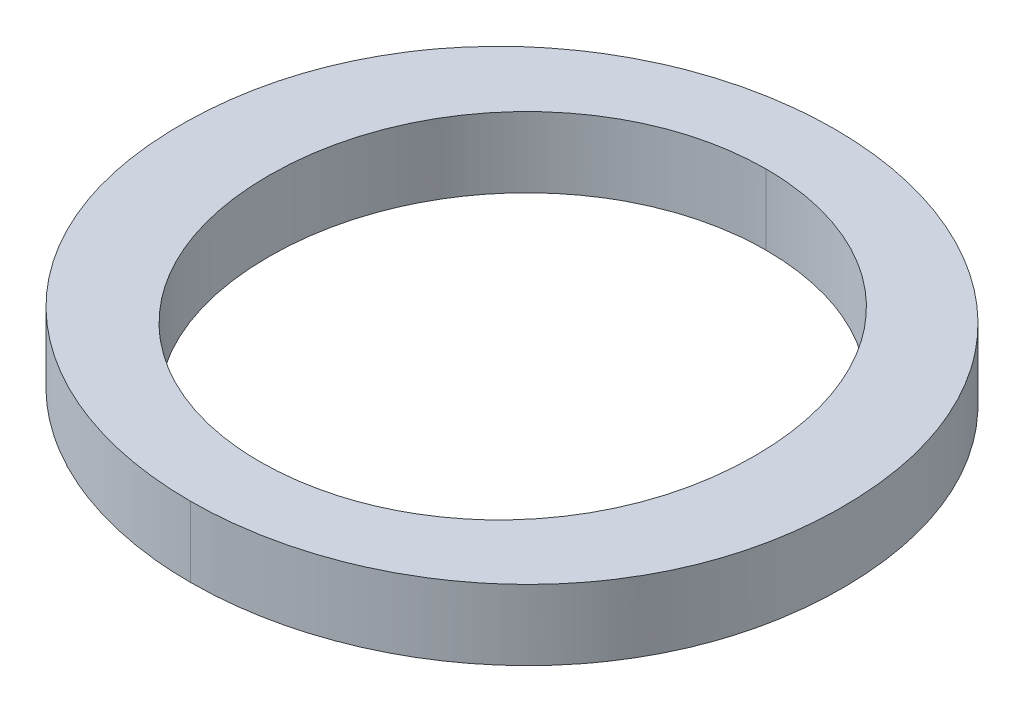
ISO-10303-21;
HEADER;
FILE_DESCRIPTION(('STEP AP214'),'2;1');
FILE_NAME('part.step','',(''),(''),'','','');
FILE_SCHEMA(('AUTOMOTIVE_DESIGN { 1 0 10303 214 1 1 1 1 }'));
ENDSEC;
DATA;
#1=APPLICATION_CONTEXT('core data for automotive mechanical design processes');
#2=APPLICATION_PROTOCOL_DEFINITION('international standard','automotive_design',2000,#1);
#3=PRODUCT_CONTEXT('',#1,'mechanical');
#4=PRODUCT('Part','Part','',(#3));
#5=PRODUCT_RELATED_PRODUCT_CATEGORY('part','',(#4));
#6=PRODUCT_DEFINITION_FORMATION('','',#4);
#7=PRODUCT_DEFINITION_CONTEXT('part definition',#1,'design');
#8=PRODUCT_DEFINITION('design','',#6,#7);
#9=PRODUCT_DEFINITION_SHAPE('','',#8);
#10=(LENGTH_UNIT() NAMED_UNIT(*) SI_UNIT(.MILLI.,.METRE.));
#11=(NAMED_UNIT(*) PLANE_ANGLE_UNIT() SI_UNIT($,.RADIAN.));
#12=(NAMED_UNIT(*) SI_UNIT($,.STERADIAN.) SOLID_ANGLE_UNIT());
#13=UNCERTAINTY_MEASURE_WITH_UNIT(LENGTH_MEASURE(1.E-05),#10,'distance_accuracy_value','');
#14=(GEOMETRIC_REPRESENTATION_CONTEXT(3) GLOBAL_UNCERTAINTY_ASSIGNED_CONTEXT((#13)) GLOBAL_UNIT_ASSIGNED_CONTEXT((#10,
#11,#12)) REPRESENTATION_CONTEXT('',''));
#15=CARTESIAN_POINT('',(0.,0.,0.));
#16=DIRECTION('',(0.,0.,1.));
#17=DIRECTION('',(1.,0.,0.));
#18=AXIS2_PLACEMENT_3D('',#15,#16,#17);
#19=CARTESIAN_POINT('',(-26.751562473,12.954,-114.301890999));
#20=DIRECTION('',(0.,1.,0.));
#21=DIRECTION('',(0.,0.,1.));
#22=AXIS2_PLACEMENT_3D('',#19,#20,#21);
#23=PLANE('',#22);
#24=CARTESIAN_POINT('',(-25.5364239390392,12.954,-112.210124931));
#25=CARTESIAN_POINT('',(-25.5106206089015,12.954,-112.210124245059));
#26=CARTESIAN_POINT('',(-25.4848259569282,12.954,-112.211182271389));
#27=CARTESIAN_POINT('',(-25.43340858485,12.954,-112.215467339882));
#28=CARTESIAN_POINT('',(-25.4077859330739,12.954,-112.21869519785));
#29=CARTESIAN_POINT('',(-25.3314540776071,12.954,-112.231706926495));
#30=CARTESIAN_POINT('',(-25.281263668217,12.954,-112.244818884106));
#31=CARTESIAN_POINT('',(-25.1851064529542,12.954,-112.27944918463));
#32=CARTESIAN_POINT('',(-25.1390721551074,12.954,-112.300781227924));
#33=CARTESIAN_POINT('',(-25.0515879250059,12.954,-112.351301114305));
#34=CARTESIAN_POINT('',(-25.0101328534025,12.954,-112.3804800217));
#35=CARTESIAN_POINT('',(-24.9352562175803,12.954,-112.443949863995));
#36=CARTESIAN_POINT('',(-24.9015162505308,12.954,-112.477866630236));
#37=CARTESIAN_POINT('',(-24.8401659182951,12.954,-112.550854055029));
#38=CARTESIAN_POINT('',(-24.8125564494561,12.954,-112.589925465916));
#39=CARTESIAN_POINT('',(-24.7638893603896,12.954,-112.672328247418));
#40=CARTESIAN_POINT('',(-24.7428811126103,12.954,-112.715688672155));
#41=CARTESIAN_POINT('',(-24.7079424083198,12.954,-112.80515290053));
#42=CARTESIAN_POINT('',(-24.6940130623446,12.954,-112.851257133349));
#43=CARTESIAN_POINT('',(-24.6724498315564,12.954,-112.948177940799));
#44=CARTESIAN_POINT('',(-24.6653024695735,12.954,-112.999102882565));
#45=CARTESIAN_POINT('',(-24.6602092427702,12.954,-113.075830248181));
#46=CARTESIAN_POINT('',(-24.659451407731,12.954,-113.101486913085));
#47=CARTESIAN_POINT('',(-24.6597382380023,12.954,-113.152797586881));
#48=CARTESIAN_POINT('',(-24.6607830469167,12.954,-113.178451595398));
#49=CARTESIAN_POINT('',(-24.6650369414751,12.954,-113.233190432615));
#50=CARTESIAN_POINT('',(-24.6685277786282,12.954,-113.262254294482));
#51=CARTESIAN_POINT('',(-24.6780316448757,12.954,-113.319958294908));
#52=CARTESIAN_POINT('',(-24.6840447121588,12.954,-113.348598427045));
#53=CARTESIAN_POINT('',(-24.7059504580031,12.954,-113.433460896468));
#54=CARTESIAN_POINT('',(-24.7257188245342,12.954,-113.488752831852));
#55=CARTESIAN_POINT('',(-24.7738963640096,12.954,-113.591100850464));
#56=CARTESIAN_POINT('',(-24.8016697297799,12.954,-113.638457740123));
#57=CARTESIAN_POINT('',(-24.8655881539914,12.954,-113.727175776605));
#58=CARTESIAN_POINT('',(-24.9017316725486,12.954,-113.768538024008));
#59=CARTESIAN_POINT('',(-24.9773924322689,12.954,-113.839954813731));
#60=CARTESIAN_POINT('',(-25.0162453354519,12.954,-113.870716077181));
#61=CARTESIAN_POINT('',(-25.0987174834469,12.954,-113.92499789025));
#62=CARTESIAN_POINT('',(-25.1423356895447,12.954,-113.948520013565));
#63=CARTESIAN_POINT('',(-25.2314552689444,12.954,-113.986986180677));
#64=CARTESIAN_POINT('',(-25.2768452125777,12.954,-114.002190306649));
#65=CARTESIAN_POINT('',(-25.3694706637422,12.954,-114.024919236854));
#66=CARTESIAN_POINT('',(-25.416703850443,12.954,-114.032453393808));
#67=CARTESIAN_POINT('',(-25.4761968074136,12.954,-114.037167414555));
#68=CARTESIAN_POINT('',(-25.488242490633,12.954,-114.037878245098));
#69=CARTESIAN_POINT('',(-25.5123321044532,12.954,-114.038822401001));
#70=CARTESIAN_POINT('',(-25.5243760032158,12.954,-114.03905653613));
#71=CARTESIAN_POINT('',(-25.5364239390392,12.954,-114.039057222));
#72=B_SPLINE_CURVE_WITH_KNOTS('',3,(#24,#25,#26,#27,#28,#29,#30,#31,#32,#33,#34,#35,#36,#37,#38,
#39,#40,#41,#42,#43,#44,#45,#46,#47,#48,#49,#50,#51,#52,#53,#54,#55,#56,#57,#58,#59,#60,#61,#62,
#63,#64,#65,#66,#67,#68,#69,#70,#71),.UNSPECIFIED.,.F.,.F.,(4,2,2,2,2,2,2,2,2,2,2,2,2,2,2,2,2,2,
2,2,2,2,2,4),(0.,0.0773680171093985,0.154765138996763,0.309508146777117,0.460932783036454,
0.612185707939161,0.755033723289658,0.897902610879189,1.04181593355671,1.185751826346,
1.33937016938016,1.41632379148428,1.49328354422125,1.58098605158486,1.66868988688921,
1.84371937983329,2.00751840984756,2.17128732913191,2.3192178197525,2.4671161294065,
2.61007854728889,2.75286642795938,2.78906126565284,2.82519456707597),.UNSPECIFIED.);
#73=CARTESIAN_POINT('',(-25.5364239390392,12.954,-112.210124931));
#74=VERTEX_POINT('',#73);
#75=CARTESIAN_POINT('',(-25.5364239390196,12.954,-114.039057222));
#76=VERTEX_POINT('',#75);
#77=EDGE_CURVE('E78',#74,#76,#72,.T.);
#78=ORIENTED_EDGE('',*,*,#77,.F.);
#79=CARTESIAN_POINT('',(-25.5364239390392,12.954,-114.039057222));
#80=CARTESIAN_POINT('',(-25.5612123829451,12.954,-114.039058509188));
#81=CARTESIAN_POINT('',(-25.5859914255243,12.954,-114.038030512108));
#82=CARTESIAN_POINT('',(-25.6353772773855,12.954,-114.033891479779));
#83=CARTESIAN_POINT('',(-25.6599840664513,12.954,-114.030780204037));
#84=CARTESIAN_POINT('',(-25.7332215915287,12.954,-114.01829969386));
#85=CARTESIAN_POINT('',(-25.7813574582871,12.954,-114.005783938767));
#86=CARTESIAN_POINT('',(-25.8742299662193,12.954,-113.972789830264));
#87=CARTESIAN_POINT('',(-25.9189966207895,12.954,-113.952395188882));
#88=CARTESIAN_POINT('',(-26.0043703675999,12.954,-113.904257259582));
#89=CARTESIAN_POINT('',(-26.04497902527,12.954,-113.876516751495));
#90=CARTESIAN_POINT('',(-26.1202557154007,12.954,-113.815093353156));
#91=CARTESIAN_POINT('',(-26.1550132140715,12.954,-113.781519819943));
#92=CARTESIAN_POINT('',(-26.2185518671057,12.954,-113.709124657691));
#93=CARTESIAN_POINT('',(-26.2473317939899,12.954,-113.670301953446));
#94=CARTESIAN_POINT('',(-26.2988513155795,12.954,-113.587603146991));
#95=CARTESIAN_POINT('',(-26.3214379432142,12.954,-113.543631881036));
#96=CARTESIAN_POINT('',(-26.3592924970375,12.954,-113.452664343206));
#97=CARTESIAN_POINT('',(-26.3745598372042,12.954,-113.405667829454));
#98=CARTESIAN_POINT('',(-26.3982874284844,12.954,-113.307479966681));
#99=CARTESIAN_POINT('',(-26.4063679697442,12.954,-113.256196440019));
#100=CARTESIAN_POINT('',(-26.4125944609852,12.954,-113.17883341245));
#101=CARTESIAN_POINT('',(-26.4136858923633,12.954,-113.152949298344));
#102=CARTESIAN_POINT('',(-26.4139777582284,12.954,-113.10116266428));
#103=CARTESIAN_POINT('',(-26.4131780230878,12.954,-113.075260142879));
#104=CARTESIAN_POINT('',(-26.4094295804439,12.954,-113.02088835643));
#105=CARTESIAN_POINT('',(-26.4062652902534,12.954,-112.99243336767));
#106=CARTESIAN_POINT('',(-26.3974710520772,12.954,-112.935915177639));
#107=CARTESIAN_POINT('',(-26.3918411760795,12.954,-112.907851964955));
#108=CARTESIAN_POINT('',(-26.3711873900081,12.954,-112.824659089898));
#109=CARTESIAN_POINT('',(-26.3523916172406,12.954,-112.770405142286));
#110=CARTESIAN_POINT('',(-26.3062511345635,12.954,-112.669473272805));
#111=CARTESIAN_POINT('',(-26.2794716444952,12.954,-112.622537734798));
#112=CARTESIAN_POINT('',(-26.2332367356292,12.954,-112.556453011523));
#113=CARTESIAN_POINT('',(-26.2168089579211,12.954,-112.535139421848));
#114=CARTESIAN_POINT('',(-26.1820304402471,12.954,-112.494105270213));
#115=CARTESIAN_POINT('',(-26.1636777339707,12.954,-112.474386374359));
#116=CARTESIAN_POINT('',(-26.1091110512595,12.954,-112.421020634598));
#117=CARTESIAN_POINT('',(-26.0707788358556,12.954,-112.389492395813));
#118=CARTESIAN_POINT('',(-25.9892735413517,12.954,-112.333542806637));
#119=CARTESIAN_POINT('',(-25.946101669201,12.954,-112.309119689757));
#120=CARTESIAN_POINT('',(-25.8573056777664,12.954,-112.268569987653));
#121=CARTESIAN_POINT('',(-25.8117670596673,12.954,-112.252255564413));
#122=CARTESIAN_POINT('',(-25.7186456145932,12.954,-112.227430057596));
#123=CARTESIAN_POINT('',(-25.6710652758612,12.954,-112.218909743082));
#124=CARTESIAN_POINT('',(-25.6087448261241,12.954,-112.212890624606));
#125=CARTESIAN_POINT('',(-25.5942857518562,12.954,-112.211850517371));
#126=CARTESIAN_POINT('',(-25.5653608334749,12.954,-112.210468707273));
#127=CARTESIAN_POINT('',(-25.5508950507333,12.954,-112.2101257233));
#128=CARTESIAN_POINT('',(-25.5364239390392,12.954,-112.210124931));
#129=B_SPLINE_CURVE_WITH_KNOTS('',3,(#79,#80,#81,#82,#83,#84,#85,#86,#87,#88,#89,#90,#91,#92,
#93,#94,#95,#96,#97,#98,#99,#100,#101,#102,#103,#104,#105,#106,#107,#108,#109,#110,#111,#112,
#113,#114,#115,#116,#117,#118,#119,#120,#121,#122,#123,#124,#125,#126,#127,#128),.UNSPECIFIED.,
.F.,.F.,(4,2,2,2,2,2,2,2,2,2,2,2,2,2,2,2,2,2,2,2,2,2,2,2,4),(0.,0.0743235024982695,
0.148655586347962,0.297059263163799,0.443927712519011,0.590740662982853,0.735050981476287,
0.879390904490538,1.02702740191968,1.17467571795204,1.32972747498832,1.40739321019826,
1.485065911886,1.57084554991418,1.65662268359135,1.82781820056249,1.98898630675534,
2.06961341747138,2.15032370588849,2.29842680729478,2.44649305547947,2.59094767113844,
2.73523097994419,2.77870931418187,2.822107675365),.UNSPECIFIED.);
#130=EDGE_CURVE('E100',#76,#74,#129,.T.);
#131=ORIENTED_EDGE('',*,*,#130,.F.);
#132=EDGE_LOOP('',(#78,#131));
#133=FACE_BOUND('',#132,.T.);
#134=CARTESIAN_POINT('',(-25.5364239390392,12.954,-114.28793092));
#135=CARTESIAN_POINT('',(-25.5005543909841,12.954,-114.287930292168));
#136=CARTESIAN_POINT('',(-25.4647005670153,12.954,-114.286440516783));
#137=CARTESIAN_POINT('',(-25.3932364629852,12.954,-114.280466014469));
#138=CARTESIAN_POINT('',(-25.3576262339399,12.954,-114.275980678475));
#139=CARTESIAN_POINT('',(-25.2514163079382,12.954,-114.257992868521));
#140=CARTESIAN_POINT('',(-25.1815244820921,12.954,-114.239958506938));
#141=CARTESIAN_POINT('',(-25.046307097493,12.954,-114.192168229553));
#142=CARTESIAN_POINT('',(-24.9809592449423,12.954,-114.162475118525));
#143=CARTESIAN_POINT('',(-24.8566539967808,12.954,-114.091900843024));
#144=CARTESIAN_POINT('',(-24.7976895745716,12.954,-114.051032158575));
#145=CARTESIAN_POINT('',(-24.6915737734291,12.954,-113.96174271112));
#146=CARTESIAN_POINT('',(-24.6439328828399,12.954,-113.91390420941));
#147=CARTESIAN_POINT('',(-24.5580820847713,12.954,-113.810426308709));
#148=CARTESIAN_POINT('',(-24.5198656411091,12.954,-113.754792358364));
#149=CARTESIAN_POINT('',(-24.4563482589453,12.954,-113.64133727148));
#150=CARTESIAN_POINT('',(-24.4303692167986,12.954,-113.583893426942));
#151=CARTESIAN_POINT('',(-24.3883539044631,12.954,-113.465438570098));
#152=CARTESIAN_POINT('',(-24.3723224133394,12.954,-113.404425858593));
#153=CARTESIAN_POINT('',(-24.355595626165,12.954,-113.311363636032));
#154=CARTESIAN_POINT('',(-24.351236903451,12.954,-113.279919513341));
#155=CARTESIAN_POINT('',(-24.3449434054011,12.954,-113.216780818805));
#156=CARTESIAN_POINT('',(-24.3430089565694,12.954,-113.185086213803));
#157=CARTESIAN_POINT('',(-24.3414394820686,12.954,-113.12161864778));
#158=CARTESIAN_POINT('',(-24.3418060894133,12.954,-113.089845647111));
#159=CARTESIAN_POINT('',(-24.3448833987776,12.954,-113.026421633092));
#160=CARTESIAN_POINT('',(-24.3475940328603,12.954,-112.994770616233));
#161=CARTESIAN_POINT('',(-24.3603928730629,12.954,-112.892722960135));
#162=CARTESIAN_POINT('',(-24.3754599219771,12.954,-112.822859811145));
#163=CARTESIAN_POINT('',(-24.4185093813723,12.954,-112.687330803825));
#164=CARTESIAN_POINT('',(-24.4464722450373,12.954,-112.621658763723));
#165=CARTESIAN_POINT('',(-24.5112309489362,12.954,-112.503229371088));
#166=CARTESIAN_POINT('',(-24.5468698913783,12.954,-112.449837189791));
#167=CARTESIAN_POINT('',(-24.6269025009,12.954,-112.350048988269));
#168=CARTESIAN_POINT('',(-24.6712996130382,12.954,-112.303655733813));
#169=CARTESIAN_POINT('',(-24.7657076081287,12.954,-112.220409133775));
#170=CARTESIAN_POINT('',(-24.8154916291578,12.954,-112.18329665463));
#171=CARTESIAN_POINT('',(-24.9202975854966,12.954,-112.117338314469));
#172=CARTESIAN_POINT('',(-24.9753216828923,12.954,-112.088495885583));
#173=CARTESIAN_POINT('',(-25.0624978514888,12.954,-112.050920555251));
#174=CARTESIAN_POINT('',(-25.093351433839,12.954,-112.039081838133));
#175=CARTESIAN_POINT('',(-25.1558706402776,12.954,-112.017899779871));
#176=CARTESIAN_POINT('',(-25.1875355679061,12.954,-112.008554372249));
#177=CARTESIAN_POINT('',(-25.2834545582011,12.954,-111.984291122153));
#178=CARTESIAN_POINT('',(-25.348714474511,12.954,-111.97311138095));
#179=CARTESIAN_POINT('',(-25.4346536124142,12.954,-111.965045764887));
#180=CARTESIAN_POINT('',(-25.455000672686,12.954,-111.963620362876));
#181=CARTESIAN_POINT('',(-25.4957034256797,12.954,-111.961724577855));
#182=CARTESIAN_POINT('',(-25.5160590401761,12.954,-111.961252518364));
#183=CARTESIAN_POINT('',(-25.5364239390392,12.954,-111.961251233));
#184=B_SPLINE_CURVE_WITH_KNOTS('',3,(#134,#135,#136,#137,#138,#139,#140,#141,#142,#143,#144,
#145,#146,#147,#148,#149,#150,#151,#152,#153,#154,#155,#156,#157,#158,#159,#160,#161,#162,#163,
#164,#165,#166,#167,#168,#169,#170,#171,#172,#173,#174,#175,#176,#177,#178,#179,#180,#181,#182,
#183),.UNSPECIFIED.,.F.,.F.,(4,2,2,2,2,2,2,2,2,2,2,2,2,2,2,2,2,2,2,2,2,2,2,2,4),(0.,
0.107545032443165,0.21511193781538,0.430503762815758,0.644750866009941,0.858759684711605,
1.06023854626662,1.26157727972777,1.44982746822075,1.63816802717399,1.73332476213794,
1.82849431155302,1.92373140854121,2.01896574536716,2.23207814573533,2.44486857758019,
2.63646896447007,2.82814486890732,3.01364732071927,3.19922664630442,3.29827351590024,
3.39723803773585,3.59490351218008,3.65608167437615,3.71715215895971),.UNSPECIFIED.);
#185=CARTESIAN_POINT('',(-25.5364239390392,12.954,-114.28793092));
#186=VERTEX_POINT('',#185);
#187=CARTESIAN_POINT('',(-25.5364239390196,12.954,-111.961251233));
#188=VERTEX_POINT('',#187);
#189=EDGE_CURVE('E22',#186,#188,#184,.T.);
#190=ORIENTED_EDGE('',*,*,#189,.F.);
#191=CARTESIAN_POINT('',(-25.5364239390392,12.954,-111.961251233));
#192=CARTESIAN_POINT('',(-25.6095343345229,12.954,-111.961202758672));
#193=CARTESIAN_POINT('',(-25.6827105935566,12.954,-111.96727968449));
#194=CARTESIAN_POINT('',(-25.8272315435797,12.954,-111.991712776202));
#195=CARTESIAN_POINT('',(-25.898569107741,12.954,-112.010110902573));
#196=CARTESIAN_POINT('',(-26.0363291420664,12.954,-112.059005948654));
#197=CARTESIAN_POINT('',(-26.1027883096712,12.954,-112.089398453594));
#198=CARTESIAN_POINT('',(-26.2289446966988,12.954,-112.161817277561));
#199=CARTESIAN_POINT('',(-26.2886529402575,12.954,-112.203824232215));
#200=CARTESIAN_POINT('',(-26.3944631256053,12.954,-112.294720477535));
#201=CARTESIAN_POINT('',(-26.4412730671617,12.954,-112.342784831694));
#202=CARTESIAN_POINT('',(-26.5253090641757,12.954,-112.446642638331));
#203=CARTESIAN_POINT('',(-26.5625419326002,12.954,-112.502430552699));
#204=CARTESIAN_POINT('',(-26.6237269571513,12.954,-112.615437808425));
#205=CARTESIAN_POINT('',(-26.6484684278038,12.954,-112.672232540028));
#206=CARTESIAN_POINT('',(-26.6882634941206,12.954,-112.789130292536));
#207=CARTESIAN_POINT('',(-26.7033114244075,12.954,-112.84923522585));
#208=CARTESIAN_POINT('',(-26.7241532462599,12.954,-112.972357639101));
#209=CARTESIAN_POINT('',(-26.7297375089422,12.954,-113.035410069734));
#210=CARTESIAN_POINT('',(-26.7313709165466,12.954,-113.13006136153));
#211=CARTESIAN_POINT('',(-26.7307886294085,12.954,-113.161647237092));
#212=CARTESIAN_POINT('',(-26.7273226136568,12.954,-113.224691766885));
#213=CARTESIAN_POINT('',(-26.7244389630052,12.954,-113.25615042539));
#214=CARTESIAN_POINT('',(-26.7110193702885,12.954,-113.358638330644));
#215=CARTESIAN_POINT('',(-26.6954153594921,12.954,-113.429094753978));
#216=CARTESIAN_POINT('',(-26.6511749707402,12.954,-113.565696972448));
#217=CARTESIAN_POINT('',(-26.6225575893069,12.954,-113.631848890829));
#218=CARTESIAN_POINT('',(-26.5564962193172,12.954,-113.750972406426));
#219=CARTESIAN_POINT('',(-26.5202318889867,12.954,-113.804600442887));
#220=CARTESIAN_POINT('',(-26.4388961665247,12.954,-113.904727209725));
#221=CARTESIAN_POINT('',(-26.3938216367279,12.954,-113.951223389602));
#222=CARTESIAN_POINT('',(-26.2981590197188,12.954,-114.034412923414));
#223=CARTESIAN_POINT('',(-26.2478158848498,12.954,-114.071389960928));
#224=CARTESIAN_POINT('',(-26.1418945847333,12.954,-114.136946532515));
#225=CARTESIAN_POINT('',(-26.0863142938378,12.954,-114.165522637277));
#226=CARTESIAN_POINT('',(-25.9984519625071,12.954,-114.202514738372));
#227=CARTESIAN_POINT('',(-25.967463169426,12.954,-114.214101433659));
#228=CARTESIAN_POINT('',(-25.9046915523816,12.954,-114.234760601802));
#229=CARTESIAN_POINT('',(-25.8729094823458,12.954,-114.243835369703));
#230=CARTESIAN_POINT('',(-25.7766886639833,12.954,-114.267253143827));
#231=CARTESIAN_POINT('',(-25.7112874251518,12.954,-114.27782628106));
#232=CARTESIAN_POINT('',(-25.6092114817138,12.954,-114.286419885679));
#233=CARTESIAN_POINT('',(-25.5727988004597,12.954,-114.287942415788));
#234=CARTESIAN_POINT('',(-25.5364239390392,12.954,-114.28793092));
#235=B_SPLINE_CURVE_WITH_KNOTS('',3,(#191,#192,#193,#194,#195,#196,#197,#198,#199,#200,#201,
#202,#203,#204,#205,#206,#207,#208,#209,#210,#211,#212,#213,#214,#215,#216,#217,#218,#219,#220,
#221,#222,#223,#224,#225,#226,#227,#228,#229,#230,#231,#232,#233,#234),.UNSPECIFIED.,.F.,.F.,(4,
2,2,2,2,2,2,2,2,2,2,2,2,2,2,2,2,2,2,2,2,4),(0.,0.219182611625406,0.439115482483608,
0.657174569143087,0.874872263183796,1.07506615244159,1.27511723082929,1.46009427720494,
1.64517933532931,1.83431305658222,1.92901980828297,2.02372335179922,2.23890619802735,
2.45377593028106,2.64699908248879,2.84029117500744,3.02689039481226,3.21356568013089,
3.3127250298113,3.41179348032204,3.60964786171972,3.71882891746114),.UNSPECIFIED.);
#236=EDGE_CURVE('E74',#188,#186,#235,.T.);
#237=ORIENTED_EDGE('',*,*,#236,.F.);
#238=EDGE_LOOP('',(#190,#237));
#239=FACE_BOUND('',#238,.T.);
#240=ADVANCED_FACE('F17',(#133,#239),#23,.T.);
#241=CARTESIAN_POINT('',(-25.536423939,12.9794,-114.28793092));
#242=CARTESIAN_POINT('',(-25.536423939,12.6746,-114.28793092));
#243=CARTESIAN_POINT('',(-24.905558054,12.9794,-114.28793092));
#244=CARTESIAN_POINT('',(-24.905558054,12.6746,-114.28793092));
#245=CARTESIAN_POINT('',(-24.341830189,12.9794,-113.827225191));
#246=CARTESIAN_POINT('',(-24.341830189,12.6746,-113.827225191));
#247=CARTESIAN_POINT('',(-24.341830189,12.9794,-112.41501165));
#248=CARTESIAN_POINT('',(-24.341830189,12.6746,-112.41501165));
#249=CARTESIAN_POINT('',(-24.905558054,12.9794,-111.961251233));
#250=CARTESIAN_POINT('',(-24.905558054,12.6746,-111.961251233));
#251=CARTESIAN_POINT('',(-25.536423939,12.9794,-111.961251233));
#252=CARTESIAN_POINT('',(-25.536423939,12.6746,-111.961251233));
#253=B_SPLINE_SURFACE_WITH_KNOTS('',3,1,((#241,#242),(#243,#244),(#245,#246),(#247,#248),(#249,
#250),(#251,#252)),.UNSPECIFIED.,.F.,.F.,.F.,(4,2,4),(2,2),(2.,3.,4.),(0.,1.),.UNSPECIFIED.);
#254=DIRECTION('',(0.,-1.,0.));
#255=VECTOR('',#254,1.);
#256=CARTESIAN_POINT('',(-25.536423939,12.827,-114.28793092));
#257=LINE('',#256,#255);
#258=CARTESIAN_POINT('',(-25.5364239390196,12.7,-114.28793092));
#259=VERTEX_POINT('',#258);
#260=EDGE_CURVE('E71',#186,#259,#257,.T.);
#261=DIRECTION('',(0.,1.,0.));
#262=VECTOR('',#261,1.);
#263=CARTESIAN_POINT('',(-25.536423939,12.827,-111.961251233));
#264=LINE('',#263,#262);
#265=CARTESIAN_POINT('',(-25.5364239390196,12.7,-111.961251233));
#266=VERTEX_POINT('',#265);
#267=EDGE_CURVE('E69',#266,#188,#264,.T.);
#268=CARTESIAN_POINT('',(-25.5364239390392,12.7,-111.961251233));
#269=CARTESIAN_POINT('',(-25.4638546238648,12.7,-111.961202885046));
#270=CARTESIAN_POINT('',(-25.3912336952835,12.7,-111.967258203921));
#271=CARTESIAN_POINT('',(-25.2478441864761,12.7,-111.991530287126));
#272=CARTESIAN_POINT('',(-25.1770815965763,12.7,-112.009782310182));
#273=CARTESIAN_POINT('',(-25.0402863833294,12.7,-112.058232957208));
#274=CARTESIAN_POINT('',(-24.9742243903661,12.7,-112.08834794945));
#275=CARTESIAN_POINT('',(-24.8487063886617,12.7,-112.160026634617));
#276=CARTESIAN_POINT('',(-24.7892412186552,12.7,-112.201574164228));
#277=CARTESIAN_POINT('',(-24.6831476627487,12.7,-112.291874783882));
#278=CARTESIAN_POINT('',(-24.6359084404133,12.7,-112.339909251087));
#279=CARTESIAN_POINT('',(-24.5509906780815,12.7,-112.443768315399));
#280=CARTESIAN_POINT('',(-24.5133050980203,12.7,-112.499587128937));
#281=CARTESIAN_POINT('',(-24.4512098902368,12.7,-112.612857226253));
#282=CARTESIAN_POINT('',(-24.4260288658977,12.7,-112.669887991182));
#283=CARTESIAN_POINT('',(-24.3854834424302,12.7,-112.787348395153));
#284=CARTESIAN_POINT('',(-24.3701243670295,12.7,-112.84777985818));
#285=CARTESIAN_POINT('',(-24.3489247517335,12.7,-112.971128065927));
#286=CARTESIAN_POINT('',(-24.3432189191996,12.7,-113.034067633923));
#287=CARTESIAN_POINT('',(-24.3414645861247,12.7,-113.128557637907));
#288=CARTESIAN_POINT('',(-24.3420167132647,12.7,-113.160090332324));
#289=CARTESIAN_POINT('',(-24.3454359408807,12.7,-113.223029297341));
#290=CARTESIAN_POINT('',(-24.3483029597912,12.7,-113.254435572357));
#291=CARTESIAN_POINT('',(-24.3616064383329,12.7,-113.356167934326));
#292=CARTESIAN_POINT('',(-24.377026382781,12.7,-113.42592943749));
#293=CARTESIAN_POINT('',(-24.4206571384172,12.7,-113.561240574163));
#294=CARTESIAN_POINT('',(-24.4488507189976,12.7,-113.626795746121));
#295=CARTESIAN_POINT('',(-24.5141168085672,12.7,-113.745446965853));
#296=CARTESIAN_POINT('',(-24.5501171162178,12.7,-113.799134772451));
#297=CARTESIAN_POINT('',(-24.6308817511234,12.7,-113.899480272906));
#298=CARTESIAN_POINT('',(-24.6756492750829,12.7,-113.946135391489));
#299=CARTESIAN_POINT('',(-24.771002153544,12.7,-114.030013381477));
#300=CARTESIAN_POINT('',(-24.8213866279729,12.7,-114.067466130008));
#301=CARTESIAN_POINT('',(-24.9274729008319,12.7,-114.133947418164));
#302=CARTESIAN_POINT('',(-24.9831767627701,12.7,-114.162972670792));
#303=CARTESIAN_POINT('',(-25.071241240319,12.7,-114.200578482781));
#304=CARTESIAN_POINT('',(-25.1022774757113,12.7,-114.212358554472));
#305=CARTESIAN_POINT('',(-25.165163126468,12.7,-114.233386177912));
#306=CARTESIAN_POINT('',(-25.1970117707214,12.7,-114.242636040134));
#307=CARTESIAN_POINT('',(-25.2934562414663,12.7,-114.266539294849));
#308=CARTESIAN_POINT('',(-25.3590423753318,12.7,-114.277385223976));
#309=CARTESIAN_POINT('',(-25.4620877950069,12.7,-114.286337154342));
#310=CARTESIAN_POINT('',(-25.499275088432,12.7,-114.287943536873));
#311=CARTESIAN_POINT('',(-25.5364239390392,12.7,-114.28793092));
#312=B_SPLINE_CURVE_WITH_KNOTS('',3,(#268,#269,#270,#271,#272,#273,#274,#275,#276,#277,#278,
#279,#280,#281,#282,#283,#284,#285,#286,#287,#288,#289,#290,#291,#292,#293,#294,#295,#296,#297,
#298,#299,#300,#301,#302,#303,#304,#305,#306,#307,#308,#309,#310,#311),.UNSPECIFIED.,.F.,.F.,(4,
2,2,2,2,2,2,2,2,2,2,2,2,2,2,2,2,2,2,2,2,4),(0.,0.217537497372765,0.435706597244065,
0.652364407031521,0.868717466174958,1.06974931798431,1.27063259626716,1.45677168944395,
1.6430115890705,1.83182958956356,1.92637394301303,2.02091496532026,2.2339704570544,
2.44673940580554,2.63968146485637,2.83269400590649,3.02023547503991,3.20784999350413,
3.30734570507007,3.406750256051,3.60526371121938,3.71676573331445),.UNSPECIFIED.);
#313=EDGE_CURVE('E106',#266,#259,#312,.T.);
#314=ORIENTED_EDGE('',*,*,#260,.F.);
#315=ORIENTED_EDGE('',*,*,#189,.T.);
#316=ORIENTED_EDGE('',*,*,#267,.F.);
#317=ORIENTED_EDGE('',*,*,#313,.T.);
#318=EDGE_LOOP('',(#314,#315,#316,#317));
#319=FACE_BOUND('',#318,.T.);
#320=ADVANCED_FACE('F67',(#319),#253,.T.);
#321=CARTESIAN_POINT('',(-25.536423939,12.9794,-111.961251233));
#322=CARTESIAN_POINT('',(-25.536423939,12.6746,-111.961251233));
#323=CARTESIAN_POINT('',(-26.168447376,12.9794,-111.961251233));
#324=CARTESIAN_POINT('',(-26.168447376,12.6746,-111.961251233));
#325=CARTESIAN_POINT('',(-26.731017689,12.9794,-112.411538993));
#326=CARTESIAN_POINT('',(-26.731017689,12.6746,-112.411538993));
#327=CARTESIAN_POINT('',(-26.731017689,12.9794,-113.830697847));
#328=CARTESIAN_POINT('',(-26.731017689,12.6746,-113.830697847));
#329=CARTESIAN_POINT('',(-26.168447376,12.9794,-114.28793092));
#330=CARTESIAN_POINT('',(-26.168447376,12.6746,-114.28793092));
#331=CARTESIAN_POINT('',(-25.536423939,12.9794,-114.28793092));
#332=CARTESIAN_POINT('',(-25.536423939,12.6746,-114.28793092));
#333=B_SPLINE_SURFACE_WITH_KNOTS('',3,1,((#321,#322),(#323,#324),(#325,#326),(#327,#328),(#329,
#330),(#331,#332)),.UNSPECIFIED.,.F.,.F.,.F.,(4,2,4),(2,2),(0.,1.,2.),(0.,1.),.UNSPECIFIED.);
#334=CARTESIAN_POINT('',(-25.5364239390392,12.7,-114.28793092));
#335=CARTESIAN_POINT('',(-25.5725606292586,12.7,-114.287930091584));
#336=CARTESIAN_POINT('',(-25.6086818815855,12.7,-114.286435096853));
#337=CARTESIAN_POINT('',(-25.6806820402832,12.7,-114.280431512928));
#338=CARTESIAN_POINT('',(-25.7165608804153,12.7,-114.275922131224));
#339=CARTESIAN_POINT('',(-25.8236060394075,12.7,-114.257815665913));
#340=CARTESIAN_POINT('',(-25.8940596312903,12.7,-114.239640083052));
#341=CARTESIAN_POINT('',(-26.0302274197799,12.7,-114.19142012031));
#342=CARTESIAN_POINT('',(-26.0959705457328,12.7,-114.161457158086));
#343=CARTESIAN_POINT('',(-26.2209189229223,12.7,-114.090164219321));
#344=CARTESIAN_POINT('',(-26.2801328444137,12.7,-114.048849577959));
#345=CARTESIAN_POINT('',(-26.3859987976704,12.7,-113.958975372218));
#346=CARTESIAN_POINT('',(-26.4332314249355,12.7,-113.911100050158));
#347=CARTESIAN_POINT('',(-26.5182378167774,12.7,-113.807603169934));
#348=CARTESIAN_POINT('',(-26.5560179746613,12.7,-113.751986887314));
#349=CARTESIAN_POINT('',(-26.6186336469693,12.7,-113.638779852919));
#350=CARTESIAN_POINT('',(-26.6441688116207,12.7,-113.581573395572));
#351=CARTESIAN_POINT('',(-26.6854229584986,12.7,-113.463686036151));
#352=CARTESIAN_POINT('',(-26.7011368052004,12.7,-113.403003334437));
#353=CARTESIAN_POINT('',(-26.7175662668159,12.7,-113.310244648817));
#354=CARTESIAN_POINT('',(-26.7218577281966,12.7,-113.278750452818));
#355=CARTESIAN_POINT('',(-26.7280326518023,12.7,-113.215518128983));
#356=CARTESIAN_POINT('',(-26.7299157737097,12.7,-113.18377996731));
#357=CARTESIAN_POINT('',(-26.7314046889893,12.7,-113.120226788362));
#358=CARTESIAN_POINT('',(-26.7310087305382,12.7,-113.088411730761));
#359=CARTESIAN_POINT('',(-26.7278889171469,12.7,-113.024904244556));
#360=CARTESIAN_POINT('',(-26.7251651251398,12.7,-112.99321181266));
#361=CARTESIAN_POINT('',(-26.7122660954724,12.7,-112.890422255688));
#362=CARTESIAN_POINT('',(-26.697028164716,12.7,-112.819865743327));
#363=CARTESIAN_POINT('',(-26.6533963527243,12.7,-112.683045741461));
#364=CARTESIAN_POINT('',(-26.6250239248327,12.7,-112.616775451433));
#365=CARTESIAN_POINT('',(-26.5594885308174,12.7,-112.497857428309));
#366=CARTESIAN_POINT('',(-26.523589333741,12.7,-112.444510748719));
#367=CARTESIAN_POINT('',(-26.442989766155,12.7,-112.344912979704));
#368=CARTESIAN_POINT('',(-26.3982859816325,12.7,-112.298664655108));
#369=CARTESIAN_POINT('',(-26.3035692363416,12.7,-112.21608109433));
#370=CARTESIAN_POINT('',(-26.2538275764979,12.7,-112.179432295008));
#371=CARTESIAN_POINT('',(-26.1491840181097,12.7,-112.11437410151));
#372=CARTESIAN_POINT('',(-26.0942797580433,12.7,-112.085968502525));
#373=CARTESIAN_POINT('',(-26.0073000588378,12.7,-112.048992138407));
#374=CARTESIAN_POINT('',(-25.976492531302,12.7,-112.037342892638));
#375=CARTESIAN_POINT('',(-25.9140841221221,12.7,-112.016522516965));
#376=CARTESIAN_POINT('',(-25.8824840042781,12.7,-112.007349094407));
#377=CARTESIAN_POINT('',(-25.7867967395137,12.7,-111.983566487085));
#378=CARTESIAN_POINT('',(-25.7217477109846,12.7,-111.97266342234));
#379=CARTESIAN_POINT('',(-25.6164197406357,12.7,-111.963049425215));
#380=CARTESIAN_POINT('',(-25.576399649112,12.7,-111.961238353803));
#381=CARTESIAN_POINT('',(-25.5364239390393,12.7,-111.961251233));
#382=B_SPLINE_CURVE_WITH_KNOTS('',3,(#334,#335,#336,#337,#338,#339,#340,#341,#342,#343,#344,
#345,#346,#347,#348,#349,#350,#351,#352,#353,#354,#355,#356,#357,#358,#359,#360,#361,#362,#363,
#364,#365,#366,#367,#368,#369,#370,#371,#372,#373,#374,#375,#376,#377,#378,#379,#380,#381),
.UNSPECIFIED.,.F.,.F.,(4,2,2,2,2,2,2,2,2,2,2,2,2,2,2,2,2,2,2,2,2,2,2,4),(0.,0.108346663149827,
0.216721822814844,0.433831620064093,0.649467411020649,0.864813316106462,1.06550651615445,
1.26606360540789,1.45313358544571,1.64030130190729,1.73558030302373,1.8308727663403,
1.92623848632518,2.02160162817752,2.23682846373794,2.45170499036096,2.6436136538648,
2.83559687772102,3.0201748123317,3.2048375927942,3.30355610750514,3.4021828911281,
3.59919510451454,3.71918162982099),.UNSPECIFIED.);
#383=EDGE_CURVE('E76',#259,#266,#382,.T.);
#384=ORIENTED_EDGE('',*,*,#267,.T.);
#385=ORIENTED_EDGE('',*,*,#236,.T.);
#386=ORIENTED_EDGE('',*,*,#260,.T.);
#387=ORIENTED_EDGE('',*,*,#383,.T.);
#388=EDGE_LOOP('',(#384,#385,#386,#387));
#389=FACE_BOUND('',#388,.T.);
#390=ADVANCED_FACE('F73',(#389),#333,.T.);
#391=CARTESIAN_POINT('',(-25.536423939,12.9794,-112.210124931));
#392=CARTESIAN_POINT('',(-25.536423939,12.6746,-112.210124931));
#393=CARTESIAN_POINT('',(-25.04793696,12.9794,-112.210124931));
#394=CARTESIAN_POINT('',(-25.04793696,12.6746,-112.210124931));
#395=CARTESIAN_POINT('',(-24.659578236,12.9794,-112.588644462));
#396=CARTESIAN_POINT('',(-24.659578236,12.6746,-112.588644462));
#397=CARTESIAN_POINT('',(-24.659578236,12.9794,-113.653592379));
#398=CARTESIAN_POINT('',(-24.659578236,12.6746,-113.653592379));
#399=CARTESIAN_POINT('',(-25.04793696,12.9794,-114.039057222));
#400=CARTESIAN_POINT('',(-25.04793696,12.6746,-114.039057222));
#401=CARTESIAN_POINT('',(-25.536423939,12.9794,-114.039057222));
#402=CARTESIAN_POINT('',(-25.536423939,12.6746,-114.039057222));
#403=B_SPLINE_SURFACE_WITH_KNOTS('',3,1,((#391,#392),(#393,#394),(#395,#396),(#397,#398),(#399,
#400),(#401,#402)),.UNSPECIFIED.,.F.,.F.,.F.,(4,2,4),(2,2),(2.,3.,4.),(0.,1.),.UNSPECIFIED.);
#404=DIRECTION('',(0.,-1.,0.));
#405=VECTOR('',#404,1.);
#406=CARTESIAN_POINT('',(-25.536423939,12.827,-112.210124931));
#407=LINE('',#406,#405);
#408=CARTESIAN_POINT('',(-25.5364239390196,12.7,-112.210124931));
#409=VERTEX_POINT('',#408);
#410=EDGE_CURVE('E41',#74,#409,#407,.T.);
#411=DIRECTION('',(0.,1.,0.));
#412=VECTOR('',#411,1.);
#413=CARTESIAN_POINT('',(-25.536423939,12.827,-114.039057222));
#414=LINE('',#413,#412);
#415=CARTESIAN_POINT('',(-25.5364239390196,12.7,-114.039057222));
#416=VERTEX_POINT('',#415);
#417=EDGE_CURVE('E107',#416,#76,#414,.T.);
#418=CARTESIAN_POINT('',(-25.5364239390392,12.7,-114.039057222));
#419=CARTESIAN_POINT('',(-25.5110307311087,12.7,-114.039058186963));
#420=CARTESIAN_POINT('',(-25.4856462228666,12.7,-114.03801445594));
#421=CARTESIAN_POINT('',(-25.4350483985534,12.7,-114.033792776321));
#422=CARTESIAN_POINT('',(-25.4098351364649,12.7,-114.03061418366));
#423=CARTESIAN_POINT('',(-25.3347534095623,12.7,-114.017817820574));
#424=CARTESIAN_POINT('',(-25.2853944220283,12.7,-114.004939631237));
#425=CARTESIAN_POINT('',(-25.1906406961997,12.7,-113.970947270029));
#426=CARTESIAN_POINT('',(-25.1451899332015,12.7,-113.949988164825));
#427=CARTESIAN_POINT('',(-25.058713385862,12.7,-113.900415785655));
#428=CARTESIAN_POINT('',(-25.0176838253935,12.7,-113.871809117314));
#429=CARTESIAN_POINT('',(-24.9429013915317,12.7,-113.809227237765));
#430=CARTESIAN_POINT('',(-24.9089132547511,12.7,-113.775532094848));
#431=CARTESIAN_POINT('',(-24.8469591274179,12.7,-113.702995619985));
#432=CARTESIAN_POINT('',(-24.8189943853523,12.7,-113.664153223843));
#433=CARTESIAN_POINT('',(-24.7692346650064,12.7,-113.58175714917));
#434=CARTESIAN_POINT('',(-24.7475589748789,12.7,-113.538131635501));
#435=CARTESIAN_POINT('',(-24.7113396407335,12.7,-113.44803590423));
#436=CARTESIAN_POINT('',(-24.6967968409379,12.7,-113.401565350632));
#437=CARTESIAN_POINT('',(-24.6740739821503,12.7,-113.303824989117));
#438=CARTESIAN_POINT('',(-24.6663813338483,12.7,-113.252441531287));
#439=CARTESIAN_POINT('',(-24.6605957767485,12.7,-113.174968884489));
#440=CARTESIAN_POINT('',(-24.6596280364636,12.7,-113.14905290949));
#441=CARTESIAN_POINT('',(-24.659532137001,12.7,-113.097209823867));
#442=CARTESIAN_POINT('',(-24.6604041508678,12.7,-113.071282712425));
#443=CARTESIAN_POINT('',(-24.6643106715196,12.7,-113.016206319349));
#444=CARTESIAN_POINT('',(-24.6676108295294,12.7,-112.987074990161));
#445=CARTESIAN_POINT('',(-24.6767550780012,12.7,-112.929223270924));
#446=CARTESIAN_POINT('',(-24.6825991571759,12.7,-112.900502879054));
#447=CARTESIAN_POINT('',(-24.7040470146319,12.7,-112.815396123651));
#448=CARTESIAN_POINT('',(-24.7235752949164,12.7,-112.759925701321));
#449=CARTESIAN_POINT('',(-24.7712653527653,12.7,-112.657708934763));
#450=CARTESIAN_POINT('',(-24.7987004096285,12.7,-112.610621772826));
#451=CARTESIAN_POINT('',(-24.8619462866174,12.7,-112.522418356475));
#452=CARTESIAN_POINT('',(-24.8977555329678,12.7,-112.4813009825));
#453=CARTESIAN_POINT('',(-24.9725539701479,12.7,-112.410494499681));
#454=CARTESIAN_POINT('',(-25.0108488924823,12.7,-112.380068263271));
#455=CARTESIAN_POINT('',(-25.092113797602,12.7,-112.326283584943));
#456=CARTESIAN_POINT('',(-25.1350828576879,12.7,-112.30292375151));
#457=CARTESIAN_POINT('',(-25.2232584659419,12.7,-112.264362087276));
#458=CARTESIAN_POINT('',(-25.2683842258676,12.7,-112.248974120493));
#459=CARTESIAN_POINT('',(-25.3605031778676,12.7,-112.225731448178));
#460=CARTESIAN_POINT('',(-25.4074944438575,12.7,-112.217869172944));
#461=CARTESIAN_POINT('',(-25.4683402138427,12.7,-112.212500190459));
#462=CARTESIAN_POINT('',(-25.4819555306376,12.7,-112.211606316949));
#463=CARTESIAN_POINT('',(-25.5091870268404,12.7,-112.210419609089));
#464=CARTESIAN_POINT('',(-25.5228031574528,12.7,-112.210125658884));
#465=CARTESIAN_POINT('',(-25.5364239390393,12.7,-112.210124931));
#466=B_SPLINE_CURVE_WITH_KNOTS('',3,(#418,#419,#420,#421,#422,#423,#424,#425,#426,#427,#428,
#429,#430,#431,#432,#433,#434,#435,#436,#437,#438,#439,#440,#441,#442,#443,#444,#445,#446,#447,
#448,#449,#450,#451,#452,#453,#454,#455,#456,#457,#458,#459,#460,#461,#462,#463,#464,#465),
.UNSPECIFIED.,.F.,.F.,(4,2,2,2,2,2,2,2,2,2,2,2,2,2,2,2,2,2,2,2,2,2,2,4),(0.,0.0761381362433109,
0.152299252938738,0.304477647567626,0.453870558716566,0.603134845520892,0.746050914649557,
0.888996577975953,1.03449875980149,1.18001815856742,1.33521418571262,1.41296427945441,
1.49072168657555,1.57855800471466,1.66639393313331,1.84165542652667,2.00423880111203,
2.16679164565573,2.31280514547911,2.45878987359443,2.6011920082355,2.74345075698029,
2.78437656437612,2.82522618027281),.UNSPECIFIED.);
#467=EDGE_CURVE('E33',#416,#409,#466,.T.);
#468=ORIENTED_EDGE('',*,*,#410,.F.);
#469=ORIENTED_EDGE('',*,*,#77,.T.);
#470=ORIENTED_EDGE('',*,*,#417,.F.);
#471=ORIENTED_EDGE('',*,*,#467,.T.);
#472=EDGE_LOOP('',(#468,#469,#470,#471));
#473=FACE_BOUND('',#472,.T.);
#474=ADVANCED_FACE('F117',(#473),#403,.T.);
#475=CARTESIAN_POINT('',(-25.536423939,12.9794,-114.039057222));
#476=CARTESIAN_POINT('',(-25.536423939,12.6746,-114.039057222));
#477=CARTESIAN_POINT('',(-26.019123158,12.9794,-114.039057222));
#478=CARTESIAN_POINT('',(-26.019123158,12.6746,-114.039057222));
#479=CARTESIAN_POINT('',(-26.413848418,12.9794,-113.650119722));
#480=CARTESIAN_POINT('',(-26.413848418,12.6746,-113.650119722));
#481=CARTESIAN_POINT('',(-26.413848418,12.9794,-112.592117118));
#482=CARTESIAN_POINT('',(-26.413848418,12.6746,-112.592117118));
#483=CARTESIAN_POINT('',(-26.019123158,12.9794,-112.210124931));
#484=CARTESIAN_POINT('',(-26.019123158,12.6746,-112.210124931));
#485=CARTESIAN_POINT('',(-25.536423939,12.9794,-112.210124931));
#486=CARTESIAN_POINT('',(-25.536423939,12.6746,-112.210124931));
#487=B_SPLINE_SURFACE_WITH_KNOTS('',3,1,((#475,#476),(#477,#478),(#479,#480),(#481,#482),(#483,
#484),(#485,#486)),.UNSPECIFIED.,.F.,.F.,.F.,(4,2,4),(2,2),(0.,1.,2.),(0.,1.),.UNSPECIFIED.);
#488=CARTESIAN_POINT('',(-25.5364239390392,12.7,-112.210124931));
#489=CARTESIAN_POINT('',(-25.5616091609496,12.7,-112.210123886259));
#490=CARTESIAN_POINT('',(-25.5867849949731,12.7,-112.211165861715));
#491=CARTESIAN_POINT('',(-25.6369634884719,12.7,-112.215366131357));
#492=CARTESIAN_POINT('',(-25.6619661157096,12.7,-112.218524809352));
#493=CARTESIAN_POINT('',(-25.7364092219827,12.7,-112.231210626189));
#494=CARTESIAN_POINT('',(-25.7853460782746,12.7,-112.243947407206));
#495=CARTESIAN_POINT('',(-25.879598905347,12.7,-112.277545818826));
#496=CARTESIAN_POINT('',(-25.9249539210414,12.7,-112.298298794258));
#497=CARTESIAN_POINT('',(-26.0113585841592,12.7,-112.347346068973));
#498=CARTESIAN_POINT('',(-26.0524108591846,12.7,-112.375635727915));
#499=CARTESIAN_POINT('',(-26.1278516222752,12.7,-112.437931389721));
#500=CARTESIAN_POINT('',(-26.1624028630386,12.7,-112.471740818759));
#501=CARTESIAN_POINT('',(-26.225414140479,12.7,-112.544627353945));
#502=CARTESIAN_POINT('',(-26.2538733446736,12.7,-112.583705178836));
#503=CARTESIAN_POINT('',(-26.3043246097205,12.7,-112.666443792249));
#504=CARTESIAN_POINT('',(-26.326238633517,12.7,-112.710152065677));
#505=CARTESIAN_POINT('',(-26.3627947429345,12.7,-112.800492023202));
#506=CARTESIAN_POINT('',(-26.3774360203924,12.7,-112.847124031542));
#507=CARTESIAN_POINT('',(-26.3999718732961,12.7,-112.94444995881));
#508=CARTESIAN_POINT('',(-26.4074935168273,12.7,-112.995230466261));
#509=CARTESIAN_POINT('',(-26.4130143940786,12.7,-113.071779055365));
#510=CARTESIAN_POINT('',(-26.413892676668,12.7,-113.097380587467));
#511=CARTESIAN_POINT('',(-26.413800884784,12.7,-113.148587778149));
#512=CARTESIAN_POINT('',(-26.4128306665979,12.7,-113.174193436895));
#513=CARTESIAN_POINT('',(-26.4087492217834,12.7,-113.228190704299));
#514=CARTESIAN_POINT('',(-26.4054054129743,12.7,-113.256565356405));
#515=CARTESIAN_POINT('',(-26.3962769136712,12.7,-113.312911533476));
#516=CARTESIAN_POINT('',(-26.3904922513012,12.7,-113.340883063082));
#517=CARTESIAN_POINT('',(-26.369426538299,12.7,-113.423799381541));
#518=CARTESIAN_POINT('',(-26.3504258704673,12.7,-113.477856965927));
#519=CARTESIAN_POINT('',(-26.3038514150948,12.7,-113.57893321565));
#520=CARTESIAN_POINT('',(-26.276747441402,12.7,-113.626167672776));
#521=CARTESIAN_POINT('',(-26.2300243403703,12.7,-113.692682479504));
#522=CARTESIAN_POINT('',(-26.2134337259184,12.7,-113.714136237247));
#523=CARTESIAN_POINT('',(-26.1783248095777,12.7,-113.755443939995));
#524=CARTESIAN_POINT('',(-26.1598044532967,12.7,-113.775296139276));
#525=CARTESIAN_POINT('',(-26.1045492973692,12.7,-113.829220241932));
#526=CARTESIAN_POINT('',(-26.0656518889279,12.7,-113.861126036263));
#527=CARTESIAN_POINT('',(-25.9829192990019,12.7,-113.91765343095));
#528=CARTESIAN_POINT('',(-25.9390858537285,12.7,-113.942277581583));
#529=CARTESIAN_POINT('',(-25.849312567104,12.7,-113.982790211379));
#530=CARTESIAN_POINT('',(-25.8034910635203,12.7,-113.998941701087));
#531=CARTESIAN_POINT('',(-25.7098202504554,12.7,-114.023280056756));
#532=CARTESIAN_POINT('',(-25.661973894385,12.7,-114.031478132132));
#533=CARTESIAN_POINT('',(-25.6009652359784,12.7,-114.036817569954));
#534=CARTESIAN_POINT('',(-25.588059453285,12.7,-114.037659505961));
#535=CARTESIAN_POINT('',(-25.5622452963455,12.7,-114.038778462448));
#536=CARTESIAN_POINT('',(-25.5493369636468,12.7,-114.039056438963));
#537=CARTESIAN_POINT('',(-25.5364239390392,12.7,-114.039057222));
#538=B_SPLINE_CURVE_WITH_KNOTS('',3,(#488,#489,#490,#491,#492,#493,#494,#495,#496,#497,#498,
#499,#500,#501,#502,#503,#504,#505,#506,#507,#508,#509,#510,#511,#512,#513,#514,#515,#516,#517,
#518,#519,#520,#521,#522,#523,#524,#525,#526,#527,#528,#529,#530,#531,#532,#533,#534,#535,#536,
#537),.UNSPECIFIED.,.F.,.F.,(4,2,2,2,2,2,2,2,2,2,2,2,2,2,2,2,2,2,2,2,2,2,2,2,4),(0.,
0.0755133760908356,0.151040448331075,0.301913520917812,0.450809551888332,0.599614118487189,
0.743962120242521,0.88832983471148,1.03435577450809,1.18039793739181,1.33372430450515,
1.41052079015758,1.48732324663436,1.57292584933538,1.65852746573452,1.82940129077294,
1.99183504005539,2.07309380129864,2.15443997156958,2.30455222905269,2.45461184972021,
2.59968678626664,2.74455695821033,2.78334931474127,2.8220758544999),.UNSPECIFIED.);
#539=EDGE_CURVE('E11',#409,#416,#538,.T.);
#540=ORIENTED_EDGE('',*,*,#417,.T.);
#541=ORIENTED_EDGE('',*,*,#130,.T.);
#542=ORIENTED_EDGE('',*,*,#410,.T.);
#543=ORIENTED_EDGE('',*,*,#539,.T.);
#544=EDGE_LOOP('',(#540,#541,#542,#543));
#545=FACE_BOUND('',#544,.T.);
#546=ADVANCED_FACE('F112',(#545),#487,.T.);
#547=CARTESIAN_POINT('',(-26.751562473,12.7,-114.301890999));
#548=DIRECTION('',(0.,1.,0.));
#549=DIRECTION('',(0.,0.,1.));
#550=AXIS2_PLACEMENT_3D('',#547,#548,#549);
#551=PLANE('',#550);
#552=ORIENTED_EDGE('',*,*,#467,.F.);
#553=ORIENTED_EDGE('',*,*,#539,.F.);
#554=EDGE_LOOP('',(#552,#553));
#555=FACE_BOUND('',#554,.T.);
#556=ORIENTED_EDGE('',*,*,#313,.F.);
#557=ORIENTED_EDGE('',*,*,#383,.F.);
#558=EDGE_LOOP('',(#556,#557));
#559=FACE_BOUND('',#558,.T.);
#560=ADVANCED_FACE('F19',(#555,#559),#551,.F.);
#561=CLOSED_SHELL('',(#240,#320,#390,#474,#546,#560));
#562=MANIFOLD_SOLID_BREP('B1',#561);
#563=ADVANCED_BREP_SHAPE_REPRESENTATION('',(#18,#562),#14);
#564=SHAPE_DEFINITION_REPRESENTATION(#9,#563);
ENDSEC;
END-ISO-10303-21;
